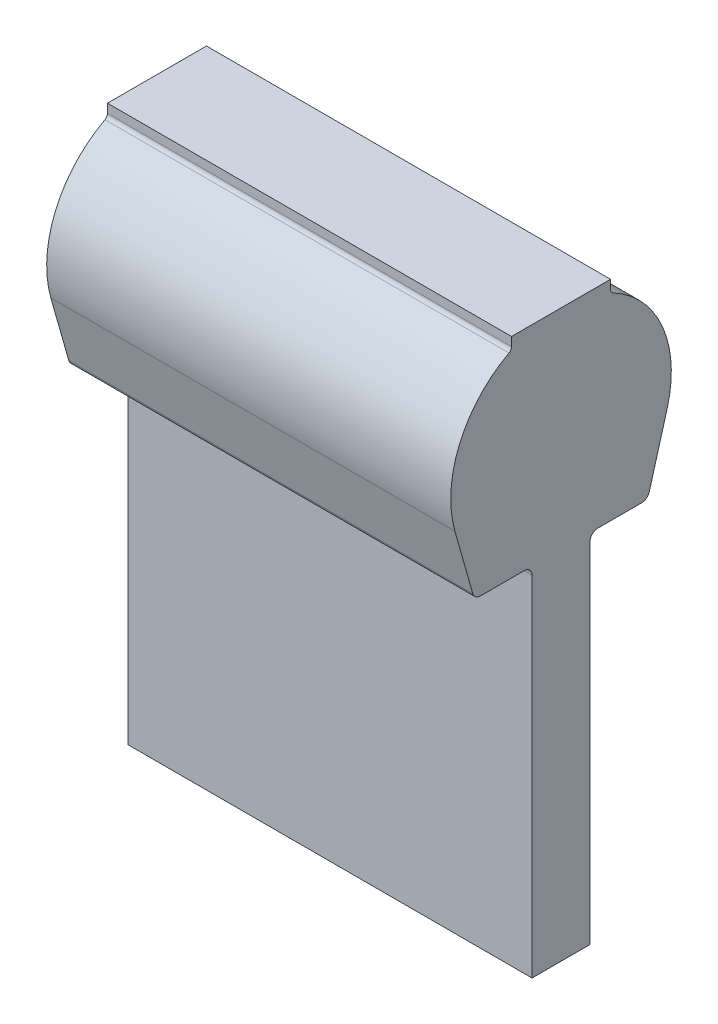
ISO-10303-21;
HEADER;
FILE_DESCRIPTION(('STEP AP214'),'2;1');
FILE_NAME('part.step','',(''),(''),'','','');
FILE_SCHEMA(('AUTOMOTIVE_DESIGN { 1 0 10303 214 1 1 1 1 }'));
ENDSEC;
DATA;
#1=APPLICATION_CONTEXT('core data for automotive mechanical design processes');
#2=APPLICATION_PROTOCOL_DEFINITION('international standard','automotive_design',2000,#1);
#3=PRODUCT_CONTEXT('',#1,'mechanical');
#4=PRODUCT('Part','Part','',(#3));
#5=PRODUCT_RELATED_PRODUCT_CATEGORY('part','',(#4));
#6=PRODUCT_DEFINITION_FORMATION('','',#4);
#7=PRODUCT_DEFINITION_CONTEXT('part definition',#1,'design');
#8=PRODUCT_DEFINITION('design','',#6,#7);
#9=PRODUCT_DEFINITION_SHAPE('','',#8);
#10=(LENGTH_UNIT() NAMED_UNIT(*) SI_UNIT(.MILLI.,.METRE.));
#11=(NAMED_UNIT(*) PLANE_ANGLE_UNIT() SI_UNIT($,.RADIAN.));
#12=(NAMED_UNIT(*) SI_UNIT($,.STERADIAN.) SOLID_ANGLE_UNIT());
#13=UNCERTAINTY_MEASURE_WITH_UNIT(LENGTH_MEASURE(1.E-05),#10,'distance_accuracy_value','');
#14=(GEOMETRIC_REPRESENTATION_CONTEXT(3) GLOBAL_UNCERTAINTY_ASSIGNED_CONTEXT((#13)) GLOBAL_UNIT_ASSIGNED_CONTEXT((#10,
#11,#12)) REPRESENTATION_CONTEXT('',''));
#15=CARTESIAN_POINT('',(0.,0.,0.));
#16=DIRECTION('',(0.,0.,1.));
#17=DIRECTION('',(1.,0.,0.));
#18=AXIS2_PLACEMENT_3D('',#15,#16,#17);
#19=CARTESIAN_POINT('',(3.175,-66.040000000336,4.76249999679612));
#20=DIRECTION('',(1.,0.,0.));
#21=DIRECTION('',(0.,1.,7.05461458278207E-11));
#22=AXIS2_PLACEMENT_3D('',#19,#20,#21);
#23=PLANE('',#22);
#24=DIRECTION('',(0.,1.,0.));
#25=VECTOR('',#24,1.);
#26=CARTESIAN_POINT('',(3.175,-57.0484000003279,4.64819999809909));
#27=LINE('',#26,#25);
#28=CARTESIAN_POINT('',(3.175,-57.0484000003279,4.64819999809909));
#29=VERTEX_POINT('',#28);
#30=CARTESIAN_POINT('',(3.175,-1.14299999966327,4.64819999809909));
#31=VERTEX_POINT('',#30);
#32=EDGE_CURVE('E170',#29,#31,#27,.T.);
#33=ORIENTED_EDGE('',*,*,#32,.F.);
#34=DIRECTION('',(0.,-7.05466156357296E-11,1.));
#35=VECTOR('',#34,1.);
#36=CARTESIAN_POINT('',(3.175,-57.0483999996721,-4.64819999809909));
#37=LINE('',#36,#35);
#38=CARTESIAN_POINT('',(3.175,-57.0483999996721,-4.64819999809909));
#39=VERTEX_POINT('',#38);
#40=EDGE_CURVE('E202',#39,#29,#37,.T.);
#41=ORIENTED_EDGE('',*,*,#40,.F.);
#42=DIRECTION('',(0.,-1.,0.));
#43=VECTOR('',#42,1.);
#44=CARTESIAN_POINT('',(3.175,0.12700000033687,-4.64819999809909));
#45=LINE('',#44,#43);
#46=CARTESIAN_POINT('',(3.175,-1.14299999966327,-4.64819999809909));
#47=VERTEX_POINT('',#46);
#48=EDGE_CURVE('E205',#47,#39,#45,.T.);
#49=ORIENTED_EDGE('',*,*,#48,.F.);
#50=CARTESIAN_POINT('',(3.175,-1.14299999966327,-5.91819999809909));
#51=DIRECTION('',(1.,0.,0.));
#52=DIRECTION('',(0.,1.,0.));
#53=AXIS2_PLACEMENT_3D('',#50,#51,#52);
#54=CIRCLE('',#53,1.27);
#55=CARTESIAN_POINT('',(3.175,0.127000000336732,-5.91819999809923));
#56=VERTEX_POINT('',#55);
#57=EDGE_CURVE('E10',#47,#56,#54,.F.);
#58=ORIENTED_EDGE('',*,*,#57,.T.);
#59=DIRECTION('',(0.,1.08273752351954E-13,1.));
#60=VECTOR('',#59,1.);
#61=CARTESIAN_POINT('',(3.175,0.127000000335974,-12.922127248338));
#62=LINE('',#61,#60);
#63=CARTESIAN_POINT('',(3.175,0.127000000335974,-12.922127248338));
#64=VERTEX_POINT('',#63);
#65=EDGE_CURVE('E207',#64,#56,#62,.T.);
#66=ORIENTED_EDGE('',*,*,#65,.F.);
#67=CARTESIAN_POINT('',(3.175,1.39700000033597,-12.922127248338));
#68=DIRECTION('',(1.,0.,0.));
#69=DIRECTION('',(0.,1.,0.));
#70=AXIS2_PLACEMENT_3D('',#67,#68,#69);
#71=CIRCLE('',#70,1.27);
#72=CARTESIAN_POINT('',(3.175,1.05065054111298,-14.1439873271097));
#73=VERTEX_POINT('',#72);
#74=EDGE_CURVE('E211',#73,#64,#71,.F.);
#75=ORIENTED_EDGE('',*,*,#74,.F.);
#76=DIRECTION('',(0.,-0.962094550213923,0.272716109624402));
#77=VECTOR('',#76,1.);
#78=CARTESIAN_POINT('',(3.175,11.1554155318055,-17.0082922920613));
#79=LINE('',#78,#77);
#80=CARTESIAN_POINT('',(3.175,11.1554155324371,-17.0082922898329));
#81=VERTEX_POINT('',#80);
#82=EDGE_CURVE('E215',#81,#73,#79,.T.);
#83=ORIENTED_EDGE('',*,*,#82,.F.);
#84=CARTESIAN_POINT('',(3.175,15.9766,2.58208317568858E-09));
#85=DIRECTION('',(1.,0.,0.));
#86=DIRECTION('',(0.,1.,0.));
#87=AXIS2_PLACEMENT_3D('',#84,#85,#86);
#88=CIRCLE('',#87,17.6783999947532);
#89=CARTESIAN_POINT('',(3.175,31.5640934037434,-8.34001652235912));
#90=VERTEX_POINT('',#89);
#91=EDGE_CURVE('E219',#90,#81,#88,.F.);
#92=ORIENTED_EDGE('',*,*,#91,.F.);
#93=CARTESIAN_POINT('',(3.175,32.2359681168137,-8.69949999627089));
#94=DIRECTION('',(1.,0.,0.));
#95=DIRECTION('',(0.,1.,0.));
#96=AXIS2_PLACEMENT_3D('',#93,#94,#95);
#97=CIRCLE('',#96,0.761999998739524);
#98=CARTESIAN_POINT('',(3.175,32.2359681167599,-7.93749999627089));
#99=VERTEX_POINT('',#98);
#100=EDGE_CURVE('E223',#99,#90,#97,.T.);
#101=ORIENTED_EDGE('',*,*,#100,.F.);
#102=DIRECTION('',(0.,-1.,-2.03597071453518E-09));
#103=VECTOR('',#102,1.);
#104=CARTESIAN_POINT('',(3.175,33.6549999994408,-7.93749999338178));
#105=LINE('',#104,#103);
#106=CARTESIAN_POINT('',(3.175,33.6549999994408,-7.93749999338178));
#107=VERTEX_POINT('',#106);
#108=EDGE_CURVE('E227',#107,#99,#105,.T.);
#109=ORIENTED_EDGE('',*,*,#108,.F.);
#110=DIRECTION('',(0.,0.,-1.));
#111=VECTOR('',#110,1.);
#112=CARTESIAN_POINT('',(3.175,33.6549999994408,7.93749999774156));
#113=LINE('',#112,#111);
#114=CARTESIAN_POINT('',(3.175,33.6549999994408,7.93749999774156));
#115=VERTEX_POINT('',#114);
#116=EDGE_CURVE('E231',#115,#107,#113,.T.);
#117=ORIENTED_EDGE('',*,*,#116,.F.);
#118=DIRECTION('',(0.,1.,-5.99601582007683E-09));
#119=VECTOR('',#118,1.);
#120=CARTESIAN_POINT('',(3.175,32.23596811564,7.9375000062501));
#121=LINE('',#120,#119);
#122=CARTESIAN_POINT('',(3.175,32.23596811564,7.93750000856625));
#123=VERTEX_POINT('',#122);
#124=EDGE_CURVE('E235',#123,#115,#121,.T.);
#125=ORIENTED_EDGE('',*,*,#124,.F.);
#126=CARTESIAN_POINT('',(3.175,32.2359681155861,8.69950000372912));
#127=DIRECTION('',(1.,0.,0.));
#128=DIRECTION('',(0.,1.,0.));
#129=AXIS2_PLACEMENT_3D('',#126,#127,#128);
#130=CIRCLE('',#129,0.761999995162866);
#131=CARTESIAN_POINT('',(3.175,31.5640934079443,8.34001653440021));
#132=VERTEX_POINT('',#131);
#133=EDGE_CURVE('E239',#132,#123,#130,.T.);
#134=ORIENTED_EDGE('',*,*,#133,.F.);
#135=CARTESIAN_POINT('',(3.175,15.9766,2.58208317568858E-09));
#136=DIRECTION('',(1.,0.,0.));
#137=DIRECTION('',(0.,1.,0.));
#138=AXIS2_PLACEMENT_3D('',#135,#136,#137);
#139=CIRCLE('',#138,17.678399998125);
#140=CARTESIAN_POINT('',(3.175,11.15541552883,17.0082922985764));
#141=VERTEX_POINT('',#140);
#142=EDGE_CURVE('E243',#141,#132,#139,.F.);
#143=ORIENTED_EDGE('',*,*,#142,.F.);
#144=DIRECTION('',(0.,0.962094550146906,0.272716109860828));
#145=VECTOR('',#144,1.);
#146=CARTESIAN_POINT('',(3.175,1.05065054081272,14.1439873317006));
#147=LINE('',#146,#145);
#148=CARTESIAN_POINT('',(3.175,1.05065054081272,14.1439873317006));
#149=VERTEX_POINT('',#148);
#150=EDGE_CURVE('E155',#149,#141,#147,.T.);
#151=ORIENTED_EDGE('',*,*,#150,.F.);
#152=CARTESIAN_POINT('',(3.175,1.39700000033597,12.922127253014));
#153=DIRECTION('',(1.,0.,0.));
#154=DIRECTION('',(0.,1.,0.));
#155=AXIS2_PLACEMENT_3D('',#152,#153,#154);
#156=CIRCLE('',#155,1.27);
#157=CARTESIAN_POINT('',(3.175,0.127000000335974,12.922127253014));
#158=VERTEX_POINT('',#157);
#159=EDGE_CURVE('E153',#158,#149,#156,.F.);
#160=ORIENTED_EDGE('',*,*,#159,.F.);
#161=DIRECTION('',(0.,-1.08473585847683E-13,1.));
#162=VECTOR('',#161,1.);
#163=CARTESIAN_POINT('',(3.175,0.127000000336872,4.64819999809909));
#164=LINE('',#163,#162);
#165=CARTESIAN_POINT('',(3.175,0.127000000336734,5.91819999809922));
#166=VERTEX_POINT('',#165);
#167=EDGE_CURVE('E139',#166,#158,#164,.T.);
#168=ORIENTED_EDGE('',*,*,#167,.F.);
#169=CARTESIAN_POINT('',(3.175,-1.14299999966326,5.91819999809909));
#170=DIRECTION('',(1.,0.,0.));
#171=DIRECTION('',(0.,1.,0.));
#172=AXIS2_PLACEMENT_3D('',#169,#170,#171);
#173=CIRCLE('',#172,1.27);
#174=EDGE_CURVE('E178',#166,#31,#173,.F.);
#175=ORIENTED_EDGE('',*,*,#174,.T.);
#176=EDGE_LOOP('',(#33,#41,#49,#58,#66,#75,#83,#92,#101,#109,#117,#125,#134,#143,#151,#160,#168,#175));
#177=FACE_BOUND('',#176,.T.);
#178=ADVANCED_FACE('F16',(#177),#23,.T.);
#179=CARTESIAN_POINT('',(-61.595,1.39700000033597,12.922127253014));
#180=DIRECTION('',(1.,0.,0.));
#181=DIRECTION('',(0.,1.,0.));
#182=AXIS2_PLACEMENT_3D('',#179,#180,#181);
#183=PLANE('',#182);
#184=DIRECTION('',(0.,1.,0.));
#185=VECTOR('',#184,1.);
#186=CARTESIAN_POINT('',(-61.595,-57.0484000003279,4.64819999809909));
#187=LINE('',#186,#185);
#188=CARTESIAN_POINT('',(-61.595,-57.0484000003279,4.64819999809909));
#189=VERTEX_POINT('',#188);
#190=CARTESIAN_POINT('',(-61.595,-1.14299999966327,4.64819999809909));
#191=VERTEX_POINT('',#190);
#192=EDGE_CURVE('E195',#189,#191,#187,.T.);
#193=ORIENTED_EDGE('',*,*,#192,.T.);
#194=CARTESIAN_POINT('',(-61.595,-1.14299999966327,5.91819999809909));
#195=DIRECTION('',(1.,0.,0.));
#196=DIRECTION('',(0.,1.,0.));
#197=AXIS2_PLACEMENT_3D('',#194,#195,#196);
#198=CIRCLE('',#197,1.27);
#199=CARTESIAN_POINT('',(-61.595,0.127000000336732,5.91819999809922));
#200=VERTEX_POINT('',#199);
#201=EDGE_CURVE('E176',#191,#200,#198,.T.);
#202=ORIENTED_EDGE('',*,*,#201,.T.);
#203=DIRECTION('',(0.,-1.08473585847683E-13,1.));
#204=VECTOR('',#203,1.);
#205=CARTESIAN_POINT('',(-61.595,0.127000000336869,4.64819999809909));
#206=LINE('',#205,#204);
#207=CARTESIAN_POINT('',(-61.595,0.127000000335972,12.922127253014));
#208=VERTEX_POINT('',#207);
#209=EDGE_CURVE('E193',#200,#208,#206,.T.);
#210=ORIENTED_EDGE('',*,*,#209,.T.);
#211=CARTESIAN_POINT('',(-61.595,1.39700000033597,12.922127253014));
#212=DIRECTION('',(-1.,0.,0.));
#213=DIRECTION('',(0.,1.,0.));
#214=AXIS2_PLACEMENT_3D('',#211,#212,#213);
#215=CIRCLE('',#214,1.27);
#216=CARTESIAN_POINT('',(-61.595,1.05065054081272,14.1439873317006));
#217=VERTEX_POINT('',#216);
#218=EDGE_CURVE('E162',#208,#217,#215,.T.);
#219=ORIENTED_EDGE('',*,*,#218,.T.);
#220=DIRECTION('',(0.,0.962094550146906,0.272716109860828));
#221=VECTOR('',#220,1.);
#222=CARTESIAN_POINT('',(-61.595,1.05065054081272,14.1439873317006));
#223=LINE('',#222,#221);
#224=CARTESIAN_POINT('',(-61.595,11.1554155288299,17.0082922985764));
#225=VERTEX_POINT('',#224);
#226=EDGE_CURVE('E197',#217,#225,#223,.T.);
#227=ORIENTED_EDGE('',*,*,#226,.T.);
#228=CARTESIAN_POINT('',(-61.595,15.9766,2.58208317568858E-09));
#229=DIRECTION('',(-1.,0.,0.));
#230=DIRECTION('',(0.,-1.,0.));
#231=AXIS2_PLACEMENT_3D('',#228,#229,#230);
#232=CIRCLE('',#231,17.678399998125);
#233=CARTESIAN_POINT('',(-61.595,31.5640934079443,8.34001653440021));
#234=VERTEX_POINT('',#233);
#235=EDGE_CURVE('E267',#225,#234,#232,.T.);
#236=ORIENTED_EDGE('',*,*,#235,.T.);
#237=CARTESIAN_POINT('',(-61.595,32.2359681155861,8.69950000372912));
#238=DIRECTION('',(1.,0.,0.));
#239=DIRECTION('',(0.,-1.,0.));
#240=AXIS2_PLACEMENT_3D('',#237,#238,#239);
#241=CIRCLE('',#240,0.761999995162866);
#242=CARTESIAN_POINT('',(-61.595,32.23596811564,7.93750000856625));
#243=VERTEX_POINT('',#242);
#244=EDGE_CURVE('E272',#234,#243,#241,.T.);
#245=ORIENTED_EDGE('',*,*,#244,.T.);
#246=DIRECTION('',(0.,1.,-5.99601582007683E-09));
#247=VECTOR('',#246,1.);
#248=CARTESIAN_POINT('',(-61.595,32.23596811564,7.9375000062501));
#249=LINE('',#248,#247);
#250=CARTESIAN_POINT('',(-61.595,33.6549999994408,7.93749999774156));
#251=VERTEX_POINT('',#250);
#252=EDGE_CURVE('E276',#243,#251,#249,.T.);
#253=ORIENTED_EDGE('',*,*,#252,.T.);
#254=DIRECTION('',(0.,0.,-1.));
#255=VECTOR('',#254,1.);
#256=CARTESIAN_POINT('',(-61.595,33.6549999994408,7.93749999774156));
#257=LINE('',#256,#255);
#258=CARTESIAN_POINT('',(-61.595,33.6549999994408,-7.93749999338178));
#259=VERTEX_POINT('',#258);
#260=EDGE_CURVE('E279',#251,#259,#257,.T.);
#261=ORIENTED_EDGE('',*,*,#260,.T.);
#262=DIRECTION('',(0.,-1.,-2.03597071453518E-09));
#263=VECTOR('',#262,1.);
#264=CARTESIAN_POINT('',(-61.595,33.6549999994408,-7.93749999338178));
#265=LINE('',#264,#263);
#266=CARTESIAN_POINT('',(-61.595,32.2359681167599,-7.93749999627089));
#267=VERTEX_POINT('',#266);
#268=EDGE_CURVE('E282',#259,#267,#265,.T.);
#269=ORIENTED_EDGE('',*,*,#268,.T.);
#270=CARTESIAN_POINT('',(-61.595,32.2359681168137,-8.69949999627089));
#271=DIRECTION('',(1.,0.,0.));
#272=DIRECTION('',(0.,-1.,0.));
#273=AXIS2_PLACEMENT_3D('',#270,#271,#272);
#274=CIRCLE('',#273,0.761999998739524);
#275=CARTESIAN_POINT('',(-61.595,31.5640934037434,-8.34001652235912));
#276=VERTEX_POINT('',#275);
#277=EDGE_CURVE('E285',#267,#276,#274,.T.);
#278=ORIENTED_EDGE('',*,*,#277,.T.);
#279=CARTESIAN_POINT('',(-61.595,15.9766,2.58208317568858E-09));
#280=DIRECTION('',(-1.,0.,0.));
#281=DIRECTION('',(0.,-1.,0.));
#282=AXIS2_PLACEMENT_3D('',#279,#280,#281);
#283=CIRCLE('',#282,17.6783999947532);
#284=CARTESIAN_POINT('',(-61.595,11.1554155324371,-17.0082922898329));
#285=VERTEX_POINT('',#284);
#286=EDGE_CURVE('E288',#276,#285,#283,.T.);
#287=ORIENTED_EDGE('',*,*,#286,.T.);
#288=DIRECTION('',(0.,-0.962094550213923,0.272716109624402));
#289=VECTOR('',#288,1.);
#290=CARTESIAN_POINT('',(-61.595,11.1554155318055,-17.0082922920613));
#291=LINE('',#290,#289);
#292=CARTESIAN_POINT('',(-61.595,1.05065054111298,-14.1439873271097));
#293=VERTEX_POINT('',#292);
#294=EDGE_CURVE('E291',#285,#293,#291,.T.);
#295=ORIENTED_EDGE('',*,*,#294,.T.);
#296=CARTESIAN_POINT('',(-61.595,1.39700000033597,-12.922127248338));
#297=DIRECTION('',(-1.,0.,0.));
#298=DIRECTION('',(0.,-1.,0.));
#299=AXIS2_PLACEMENT_3D('',#296,#297,#298);
#300=CIRCLE('',#299,1.27);
#301=CARTESIAN_POINT('',(-61.595,0.127000000335972,-12.922127248338));
#302=VERTEX_POINT('',#301);
#303=EDGE_CURVE('E294',#293,#302,#300,.T.);
#304=ORIENTED_EDGE('',*,*,#303,.T.);
#305=DIRECTION('',(0.,1.08273752351954E-13,1.));
#306=VECTOR('',#305,1.);
#307=CARTESIAN_POINT('',(-61.595,0.127000000335972,-12.922127248338));
#308=LINE('',#307,#306);
#309=CARTESIAN_POINT('',(-61.595,0.12700000033673,-5.91819999809923));
#310=VERTEX_POINT('',#309);
#311=EDGE_CURVE('E297',#302,#310,#308,.T.);
#312=ORIENTED_EDGE('',*,*,#311,.T.);
#313=CARTESIAN_POINT('',(-61.595,-1.14299999966327,-5.91819999809909));
#314=DIRECTION('',(1.,0.,0.));
#315=DIRECTION('',(0.,1.,0.));
#316=AXIS2_PLACEMENT_3D('',#313,#314,#315);
#317=CIRCLE('',#316,1.27);
#318=CARTESIAN_POINT('',(-61.595,-1.14299999966327,-4.64819999809909));
#319=VERTEX_POINT('',#318);
#320=EDGE_CURVE('E24',#310,#319,#317,.T.);
#321=ORIENTED_EDGE('',*,*,#320,.T.);
#322=DIRECTION('',(0.,-1.,0.));
#323=VECTOR('',#322,1.);
#324=CARTESIAN_POINT('',(-61.595,0.127000000336868,-4.64819999809909));
#325=LINE('',#324,#323);
#326=CARTESIAN_POINT('',(-61.595,-57.0483999996721,-4.64819999809909));
#327=VERTEX_POINT('',#326);
#328=EDGE_CURVE('E299',#319,#327,#325,.T.);
#329=ORIENTED_EDGE('',*,*,#328,.T.);
#330=DIRECTION('',(0.,-7.05466156357296E-11,1.));
#331=VECTOR('',#330,1.);
#332=CARTESIAN_POINT('',(-61.595,-57.0483999996721,-4.64819999809909));
#333=LINE('',#332,#331);
#334=EDGE_CURVE('E150',#327,#189,#333,.T.);
#335=ORIENTED_EDGE('',*,*,#334,.T.);
#336=EDGE_LOOP('',(#193,#202,#210,#219,#227,#236,#245,#253,#261,#269,#278,#287,#295,#304,#312,
#321,#329,#335));
#337=FACE_BOUND('',#336,.T.);
#338=ADVANCED_FACE('F192',(#337),#183,.F.);
#339=CARTESIAN_POINT('',(103.700963412051,0.127000000336875,4.64819999809909));
#340=DIRECTION('',(0.,-1.,-1.08473585847683E-13));
#341=DIRECTION('',(0.,1.08473585847683E-13,-1.));
#342=AXIS2_PLACEMENT_3D('',#339,#340,#341);
#343=PLANE('',#342);
#344=ORIENTED_EDGE('',*,*,#209,.F.);
#345=DIRECTION('',(-1.,0.,0.));
#346=VECTOR('',#345,1.);
#347=CARTESIAN_POINT('',(3.175,0.127000000336734,5.91819999809922));
#348=LINE('',#347,#346);
#349=EDGE_CURVE('E147',#200,#166,#348,.F.);
#350=ORIENTED_EDGE('',*,*,#349,.T.);
#351=ORIENTED_EDGE('',*,*,#167,.T.);
#352=DIRECTION('',(-1.,0.,0.));
#353=VECTOR('',#352,1.);
#354=CARTESIAN_POINT('',(103.700963412051,0.127000000335978,12.922127253014));
#355=LINE('',#354,#353);
#356=EDGE_CURVE('E144',#158,#208,#355,.T.);
#357=ORIENTED_EDGE('',*,*,#356,.T.);
#358=EDGE_LOOP('',(#344,#350,#351,#357));
#359=FACE_BOUND('',#358,.T.);
#360=ADVANCED_FACE('F142',(#359),#343,.T.);
#361=CARTESIAN_POINT('',(103.700963412051,1.39700000033598,12.922127253014));
#362=DIRECTION('',(-1.,0.,0.));
#363=DIRECTION('',(0.,-1.,0.));
#364=AXIS2_PLACEMENT_3D('',#361,#362,#363);
#365=CYLINDRICAL_SURFACE('',#364,1.27);
#366=ORIENTED_EDGE('',*,*,#356,.F.);
#367=ORIENTED_EDGE('',*,*,#159,.T.);
#368=DIRECTION('',(-1.,0.,0.));
#369=VECTOR('',#368,1.);
#370=CARTESIAN_POINT('',(103.700963412051,1.05065054081273,14.1439873317006));
#371=LINE('',#370,#369);
#372=EDGE_CURVE('E158',#149,#217,#371,.T.);
#373=ORIENTED_EDGE('',*,*,#372,.T.);
#374=ORIENTED_EDGE('',*,*,#218,.F.);
#375=EDGE_LOOP('',(#366,#367,#373,#374));
#376=FACE_BOUND('',#375,.T.);
#377=ADVANCED_FACE('F160',(#376),#365,.T.);
#378=CARTESIAN_POINT('',(103.700963412051,1.05065054081273,14.1439873317006));
#379=DIRECTION('',(0.,-0.272716109860828,0.962094550146906));
#380=DIRECTION('',(0.,-0.962094550146906,-0.272716109860828));
#381=AXIS2_PLACEMENT_3D('',#378,#379,#380);
#382=PLANE('',#381);
#383=ORIENTED_EDGE('',*,*,#372,.F.);
#384=ORIENTED_EDGE('',*,*,#150,.T.);
#385=DIRECTION('',(-1.,0.,0.));
#386=VECTOR('',#385,1.);
#387=CARTESIAN_POINT('',(103.700963412051,11.15541552883,17.0082922985764));
#388=LINE('',#387,#386);
#389=EDGE_CURVE('E246',#141,#225,#388,.T.);
#390=ORIENTED_EDGE('',*,*,#389,.T.);
#391=ORIENTED_EDGE('',*,*,#226,.F.);
#392=EDGE_LOOP('',(#383,#384,#390,#391));
#393=FACE_BOUND('',#392,.T.);
#394=ADVANCED_FACE('F263',(#393),#382,.T.);
#395=CARTESIAN_POINT('',(103.700963412051,15.9766,2.58208317568858E-09));
#396=DIRECTION('',(-1.,0.,0.));
#397=DIRECTION('',(0.,-1.,0.));
#398=AXIS2_PLACEMENT_3D('',#395,#396,#397);
#399=CYLINDRICAL_SURFACE('',#398,17.678399998125);
#400=ORIENTED_EDGE('',*,*,#389,.F.);
#401=ORIENTED_EDGE('',*,*,#142,.T.);
#402=DIRECTION('',(-1.,0.,0.));
#403=VECTOR('',#402,1.);
#404=CARTESIAN_POINT('',(103.700963412051,31.5640934079443,8.34001653440021));
#405=LINE('',#404,#403);
#406=EDGE_CURVE('E242',#132,#234,#405,.T.);
#407=ORIENTED_EDGE('',*,*,#406,.T.);
#408=ORIENTED_EDGE('',*,*,#235,.F.);
#409=EDGE_LOOP('',(#400,#401,#407,#408));
#410=FACE_BOUND('',#409,.T.);
#411=ADVANCED_FACE('F268',(#410),#399,.T.);
#412=CARTESIAN_POINT('',(103.700963412051,32.2359681155861,8.69950000372912));
#413=DIRECTION('',(-1.,0.,0.));
#414=DIRECTION('',(0.,-1.,0.));
#415=AXIS2_PLACEMENT_3D('',#412,#413,#414);
#416=CYLINDRICAL_SURFACE('',#415,0.761999995162866);
#417=ORIENTED_EDGE('',*,*,#406,.F.);
#418=ORIENTED_EDGE('',*,*,#133,.T.);
#419=DIRECTION('',(-1.,0.,0.));
#420=VECTOR('',#419,1.);
#421=CARTESIAN_POINT('',(103.700963412051,32.23596811564,7.93750000856625));
#422=LINE('',#421,#420);
#423=EDGE_CURVE('E238',#123,#243,#422,.T.);
#424=ORIENTED_EDGE('',*,*,#423,.T.);
#425=ORIENTED_EDGE('',*,*,#244,.F.);
#426=EDGE_LOOP('',(#417,#418,#424,#425));
#427=FACE_BOUND('',#426,.T.);
#428=ADVANCED_FACE('F341',(#427),#416,.F.);
#429=CARTESIAN_POINT('',(103.700963412051,32.23596811564,7.9375000062501));
#430=DIRECTION('',(0.,5.99601582007683E-09,1.));
#431=DIRECTION('',(0.,-1.,5.99601582007683E-09));
#432=AXIS2_PLACEMENT_3D('',#429,#430,#431);
#433=PLANE('',#432);
#434=ORIENTED_EDGE('',*,*,#423,.F.);
#435=ORIENTED_EDGE('',*,*,#124,.T.);
#436=DIRECTION('',(-1.,0.,0.));
#437=VECTOR('',#436,1.);
#438=CARTESIAN_POINT('',(103.700963412051,33.6549999994408,7.93749999774156));
#439=LINE('',#438,#437);
#440=EDGE_CURVE('E234',#115,#251,#439,.T.);
#441=ORIENTED_EDGE('',*,*,#440,.T.);
#442=ORIENTED_EDGE('',*,*,#252,.F.);
#443=EDGE_LOOP('',(#434,#435,#441,#442));
#444=FACE_BOUND('',#443,.T.);
#445=ADVANCED_FACE('F339',(#444),#433,.T.);
#446=CARTESIAN_POINT('',(103.700963412051,33.6549999994408,7.93749999774156));
#447=DIRECTION('',(0.,1.,0.));
#448=DIRECTION('',(-1.,0.,0.));
#449=AXIS2_PLACEMENT_3D('',#446,#447,#448);
#450=PLANE('',#449);
#451=ORIENTED_EDGE('',*,*,#440,.F.);
#452=ORIENTED_EDGE('',*,*,#116,.T.);
#453=DIRECTION('',(-1.,0.,0.));
#454=VECTOR('',#453,1.);
#455=CARTESIAN_POINT('',(103.700963412051,33.6549999994408,-7.93749999338178));
#456=LINE('',#455,#454);
#457=EDGE_CURVE('E230',#107,#259,#456,.T.);
#458=ORIENTED_EDGE('',*,*,#457,.T.);
#459=ORIENTED_EDGE('',*,*,#260,.F.);
#460=EDGE_LOOP('',(#451,#452,#458,#459));
#461=FACE_BOUND('',#460,.T.);
#462=ADVANCED_FACE('F335',(#461),#450,.T.);
#463=CARTESIAN_POINT('',(103.700963412051,33.6549999994408,-7.93749999338178));
#464=DIRECTION('',(0.,2.03597071453518E-09,-1.));
#465=DIRECTION('',(0.,1.,2.03597071453518E-09));
#466=AXIS2_PLACEMENT_3D('',#463,#464,#465);
#467=PLANE('',#466);
#468=ORIENTED_EDGE('',*,*,#457,.F.);
#469=ORIENTED_EDGE('',*,*,#108,.T.);
#470=DIRECTION('',(-1.,0.,0.));
#471=VECTOR('',#470,1.);
#472=CARTESIAN_POINT('',(103.700963412051,32.2359681167599,-7.93749999627089));
#473=LINE('',#472,#471);
#474=EDGE_CURVE('E226',#99,#267,#473,.T.);
#475=ORIENTED_EDGE('',*,*,#474,.T.);
#476=ORIENTED_EDGE('',*,*,#268,.F.);
#477=EDGE_LOOP('',(#468,#469,#475,#476));
#478=FACE_BOUND('',#477,.T.);
#479=ADVANCED_FACE('F332',(#478),#467,.T.);
#480=CARTESIAN_POINT('',(103.700963412051,32.2359681168137,-8.69949999627089));
#481=DIRECTION('',(-1.,0.,0.));
#482=DIRECTION('',(0.,-1.,0.));
#483=AXIS2_PLACEMENT_3D('',#480,#481,#482);
#484=CYLINDRICAL_SURFACE('',#483,0.761999998739524);
#485=ORIENTED_EDGE('',*,*,#474,.F.);
#486=ORIENTED_EDGE('',*,*,#100,.T.);
#487=DIRECTION('',(-1.,0.,0.));
#488=VECTOR('',#487,1.);
#489=CARTESIAN_POINT('',(103.700963412051,31.5640934037434,-8.34001652235912));
#490=LINE('',#489,#488);
#491=EDGE_CURVE('E222',#90,#276,#490,.T.);
#492=ORIENTED_EDGE('',*,*,#491,.T.);
#493=ORIENTED_EDGE('',*,*,#277,.F.);
#494=EDGE_LOOP('',(#485,#486,#492,#493));
#495=FACE_BOUND('',#494,.T.);
#496=ADVANCED_FACE('F327',(#495),#484,.F.);
#497=CARTESIAN_POINT('',(103.700963412051,15.9766,2.58208317568858E-09));
#498=DIRECTION('',(-1.,0.,0.));
#499=DIRECTION('',(0.,-1.,0.));
#500=AXIS2_PLACEMENT_3D('',#497,#498,#499);
#501=CYLINDRICAL_SURFACE('',#500,17.6783999947532);
#502=ORIENTED_EDGE('',*,*,#491,.F.);
#503=ORIENTED_EDGE('',*,*,#91,.T.);
#504=DIRECTION('',(-1.,0.,0.));
#505=VECTOR('',#504,1.);
#506=CARTESIAN_POINT('',(103.700963412051,11.1554155324371,-17.0082922898329));
#507=LINE('',#506,#505);
#508=EDGE_CURVE('E218',#81,#285,#507,.T.);
#509=ORIENTED_EDGE('',*,*,#508,.T.);
#510=ORIENTED_EDGE('',*,*,#286,.F.);
#511=EDGE_LOOP('',(#502,#503,#509,#510));
#512=FACE_BOUND('',#511,.T.);
#513=ADVANCED_FACE('F323',(#512),#501,.T.);
#514=CARTESIAN_POINT('',(103.700963412051,11.1554155318055,-17.0082922920613));
#515=DIRECTION('',(0.,-0.272716109624402,-0.962094550213923));
#516=DIRECTION('',(0.,0.962094550213923,-0.272716109624402));
#517=AXIS2_PLACEMENT_3D('',#514,#515,#516);
#518=PLANE('',#517);
#519=ORIENTED_EDGE('',*,*,#508,.F.);
#520=ORIENTED_EDGE('',*,*,#82,.T.);
#521=DIRECTION('',(-1.,0.,0.));
#522=VECTOR('',#521,1.);
#523=CARTESIAN_POINT('',(103.700963412051,1.05065054111299,-14.1439873271097));
#524=LINE('',#523,#522);
#525=EDGE_CURVE('E214',#73,#293,#524,.T.);
#526=ORIENTED_EDGE('',*,*,#525,.T.);
#527=ORIENTED_EDGE('',*,*,#294,.F.);
#528=EDGE_LOOP('',(#519,#520,#526,#527));
#529=FACE_BOUND('',#528,.T.);
#530=ADVANCED_FACE('F320',(#529),#518,.T.);
#531=CARTESIAN_POINT('',(103.700963412051,1.39700000033598,-12.922127248338));
#532=DIRECTION('',(-1.,0.,0.));
#533=DIRECTION('',(0.,-1.,0.));
#534=AXIS2_PLACEMENT_3D('',#531,#532,#533);
#535=CYLINDRICAL_SURFACE('',#534,1.27);
#536=ORIENTED_EDGE('',*,*,#525,.F.);
#537=ORIENTED_EDGE('',*,*,#74,.T.);
#538=DIRECTION('',(-1.,0.,0.));
#539=VECTOR('',#538,1.);
#540=CARTESIAN_POINT('',(103.700963412051,0.127000000335978,-12.922127248338));
#541=LINE('',#540,#539);
#542=EDGE_CURVE('E210',#64,#302,#541,.T.);
#543=ORIENTED_EDGE('',*,*,#542,.T.);
#544=ORIENTED_EDGE('',*,*,#303,.F.);
#545=EDGE_LOOP('',(#536,#537,#543,#544));
#546=FACE_BOUND('',#545,.T.);
#547=ADVANCED_FACE('F316',(#546),#535,.T.);
#548=CARTESIAN_POINT('',(103.700963412051,0.127000000335978,-12.922127248338));
#549=DIRECTION('',(0.,-1.,1.08273752351954E-13));
#550=DIRECTION('',(0.,-1.08273752351954E-13,-1.));
#551=AXIS2_PLACEMENT_3D('',#548,#549,#550);
#552=PLANE('',#551);
#553=ORIENTED_EDGE('',*,*,#65,.T.);
#554=DIRECTION('',(-1.,0.,0.));
#555=VECTOR('',#554,1.);
#556=CARTESIAN_POINT('',(-61.595,0.12700000033673,-5.91819999809923));
#557=LINE('',#556,#555);
#558=EDGE_CURVE('E172',#56,#310,#557,.T.);
#559=ORIENTED_EDGE('',*,*,#558,.T.);
#560=ORIENTED_EDGE('',*,*,#311,.F.);
#561=ORIENTED_EDGE('',*,*,#542,.F.);
#562=EDGE_LOOP('',(#553,#559,#560,#561));
#563=FACE_BOUND('',#562,.T.);
#564=ADVANCED_FACE('F310',(#563),#552,.T.);
#565=CARTESIAN_POINT('',(103.700963412051,0.127000000336873,-4.64819999809909));
#566=DIRECTION('',(0.,0.,-1.));
#567=DIRECTION('',(0.,1.,0.));
#568=AXIS2_PLACEMENT_3D('',#565,#566,#567);
#569=PLANE('',#568);
#570=ORIENTED_EDGE('',*,*,#328,.F.);
#571=DIRECTION('',(-1.,0.,0.));
#572=VECTOR('',#571,1.);
#573=CARTESIAN_POINT('',(3.175,-1.14299999966327,-4.64819999809909));
#574=LINE('',#573,#572);
#575=EDGE_CURVE('E37',#319,#47,#574,.F.);
#576=ORIENTED_EDGE('',*,*,#575,.T.);
#577=ORIENTED_EDGE('',*,*,#48,.T.);
#578=DIRECTION('',(-1.,0.,0.));
#579=VECTOR('',#578,1.);
#580=CARTESIAN_POINT('',(103.700963412051,-57.0483999996721,-4.64819999809909));
#581=LINE('',#580,#579);
#582=EDGE_CURVE('E204',#39,#327,#581,.T.);
#583=ORIENTED_EDGE('',*,*,#582,.T.);
#584=EDGE_LOOP('',(#570,#576,#577,#583));
#585=FACE_BOUND('',#584,.T.);
#586=ADVANCED_FACE('F372',(#585),#569,.T.);
#587=CARTESIAN_POINT('',(103.700963412051,-57.0483999996721,-4.64819999809909));
#588=DIRECTION('',(0.,-1.,-7.05466156357296E-11));
#589=DIRECTION('',(0.,7.05466156357296E-11,-1.));
#590=AXIS2_PLACEMENT_3D('',#587,#588,#589);
#591=PLANE('',#590);
#592=ORIENTED_EDGE('',*,*,#582,.F.);
#593=ORIENTED_EDGE('',*,*,#40,.T.);
#594=DIRECTION('',(-1.,0.,0.));
#595=VECTOR('',#594,1.);
#596=CARTESIAN_POINT('',(103.700963412051,-57.0484000003279,4.64819999809909));
#597=LINE('',#596,#595);
#598=EDGE_CURVE('E188',#29,#189,#597,.T.);
#599=ORIENTED_EDGE('',*,*,#598,.T.);
#600=ORIENTED_EDGE('',*,*,#334,.F.);
#601=EDGE_LOOP('',(#592,#593,#599,#600));
#602=FACE_BOUND('',#601,.T.);
#603=ADVANCED_FACE('F304',(#602),#591,.T.);
#604=CARTESIAN_POINT('',(103.700963412051,-57.0484000003279,4.64819999809909));
#605=DIRECTION('',(0.,0.,1.));
#606=DIRECTION('',(0.,-1.,0.));
#607=AXIS2_PLACEMENT_3D('',#604,#605,#606);
#608=PLANE('',#607);
#609=ORIENTED_EDGE('',*,*,#32,.T.);
#610=DIRECTION('',(-1.,0.,0.));
#611=VECTOR('',#610,1.);
#612=CARTESIAN_POINT('',(-61.595,-1.14299999966327,4.64819999809909));
#613=LINE('',#612,#611);
#614=EDGE_CURVE('E167',#31,#191,#613,.T.);
#615=ORIENTED_EDGE('',*,*,#614,.T.);
#616=ORIENTED_EDGE('',*,*,#192,.F.);
#617=ORIENTED_EDGE('',*,*,#598,.F.);
#618=EDGE_LOOP('',(#609,#615,#616,#617));
#619=FACE_BOUND('',#618,.T.);
#620=ADVANCED_FACE('F185',(#619),#608,.T.);
#621=CARTESIAN_POINT('',(103.700963412051,-1.14299999966326,5.91819999809909));
#622=DIRECTION('',(1.,0.,0.));
#623=DIRECTION('',(0.,1.,0.));
#624=AXIS2_PLACEMENT_3D('',#621,#622,#623);
#625=CYLINDRICAL_SURFACE('',#624,1.27);
#626=ORIENTED_EDGE('',*,*,#174,.F.);
#627=ORIENTED_EDGE('',*,*,#349,.F.);
#628=ORIENTED_EDGE('',*,*,#201,.F.);
#629=ORIENTED_EDGE('',*,*,#614,.F.);
#630=EDGE_LOOP('',(#626,#627,#628,#629));
#631=FACE_BOUND('',#630,.T.);
#632=ADVANCED_FACE('F191',(#631),#625,.F.);
#633=CARTESIAN_POINT('',(103.700963412051,-1.14299999966326,-5.91819999809909));
#634=DIRECTION('',(1.,0.,0.));
#635=DIRECTION('',(0.,1.,0.));
#636=AXIS2_PLACEMENT_3D('',#633,#634,#635);
#637=CYLINDRICAL_SURFACE('',#636,1.27);
#638=ORIENTED_EDGE('',*,*,#57,.F.);
#639=ORIENTED_EDGE('',*,*,#575,.F.);
#640=ORIENTED_EDGE('',*,*,#320,.F.);
#641=ORIENTED_EDGE('',*,*,#558,.F.);
#642=EDGE_LOOP('',(#638,#639,#640,#641));
#643=FACE_BOUND('',#642,.T.);
#644=ADVANCED_FACE('F18',(#643),#637,.F.);
#645=CLOSED_SHELL('',(#178,#338,#360,#377,#394,#411,#428,#445,#462,#479,#496,#513,#530,#547,
#564,#586,#603,#620,#632,#644));
#646=MANIFOLD_SOLID_BREP('B1',#645);
#647=ADVANCED_BREP_SHAPE_REPRESENTATION('',(#18,#646),#14);
#648=SHAPE_DEFINITION_REPRESENTATION(#9,#647);
ENDSEC;
END-ISO-10303-21;
